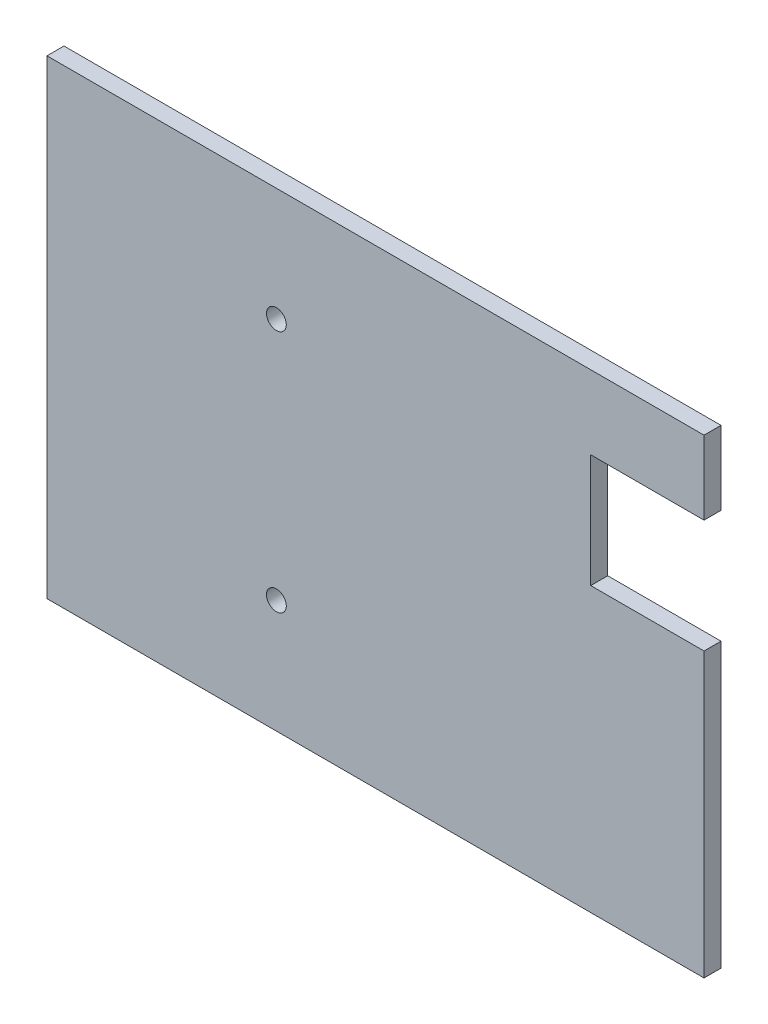
ISO-10303-21;
HEADER;
FILE_DESCRIPTION(('STEP AP214'),'2;1');
FILE_NAME('part.step','',(''),(''),'','','');
FILE_SCHEMA(('AUTOMOTIVE_DESIGN { 1 0 10303 214 1 1 1 1 }'));
ENDSEC;
DATA;
#1=APPLICATION_CONTEXT('core data for automotive mechanical design processes');
#2=APPLICATION_PROTOCOL_DEFINITION('international standard','automotive_design',2000,#1);
#3=PRODUCT_CONTEXT('',#1,'mechanical');
#4=PRODUCT('Part','Part','',(#3));
#5=PRODUCT_RELATED_PRODUCT_CATEGORY('part','',(#4));
#6=PRODUCT_DEFINITION_FORMATION('','',#4);
#7=PRODUCT_DEFINITION_CONTEXT('part definition',#1,'design');
#8=PRODUCT_DEFINITION('design','',#6,#7);
#9=PRODUCT_DEFINITION_SHAPE('','',#8);
#10=(LENGTH_UNIT() NAMED_UNIT(*) SI_UNIT(.MILLI.,.METRE.));
#11=(NAMED_UNIT(*) PLANE_ANGLE_UNIT() SI_UNIT($,.RADIAN.));
#12=(NAMED_UNIT(*) SI_UNIT($,.STERADIAN.) SOLID_ANGLE_UNIT());
#13=UNCERTAINTY_MEASURE_WITH_UNIT(LENGTH_MEASURE(1.E-05),#10,'distance_accuracy_value','');
#14=(GEOMETRIC_REPRESENTATION_CONTEXT(3) GLOBAL_UNCERTAINTY_ASSIGNED_CONTEXT((#13)) GLOBAL_UNIT_ASSIGNED_CONTEXT((#10,
#11,#12)) REPRESENTATION_CONTEXT('',''));
#15=CARTESIAN_POINT('',(0.,0.,0.));
#16=DIRECTION('',(0.,0.,1.));
#17=DIRECTION('',(1.,0.,0.));
#18=AXIS2_PLACEMENT_3D('',#15,#16,#17);
#19=CARTESIAN_POINT('',(0.,83.,3.));
#20=DIRECTION('',(-1.,0.,0.));
#21=DIRECTION('',(0.,0.,1.));
#22=AXIS2_PLACEMENT_3D('',#19,#20,#21);
#23=PLANE('',#22);
#24=DIRECTION('',(0.,1.,0.));
#25=VECTOR('',#24,1.);
#26=CARTESIAN_POINT('',(0.,83.,0.));
#27=LINE('',#26,#25);
#28=CARTESIAN_POINT('',(0.,0.,0.));
#29=VERTEX_POINT('',#28);
#30=CARTESIAN_POINT('',(0.,50.,0.));
#31=VERTEX_POINT('',#30);
#32=EDGE_CURVE('E145',#29,#31,#27,.T.);
#33=ORIENTED_EDGE('',*,*,#32,.T.);
#34=DIRECTION('',(0.,0.,1.));
#35=VECTOR('',#34,1.);
#36=CARTESIAN_POINT('',(0.,50.,3.));
#37=LINE('',#36,#35);
#38=CARTESIAN_POINT('',(0.,50.,3.));
#39=VERTEX_POINT('',#38);
#40=EDGE_CURVE('E43',#31,#39,#37,.T.);
#41=ORIENTED_EDGE('',*,*,#40,.T.);
#42=DIRECTION('',(0.,1.,0.));
#43=VECTOR('',#42,1.);
#44=CARTESIAN_POINT('',(0.,83.,3.));
#45=LINE('',#44,#43);
#46=CARTESIAN_POINT('',(0.,0.,3.));
#47=VERTEX_POINT('',#46);
#48=EDGE_CURVE('E129',#47,#39,#45,.T.);
#49=ORIENTED_EDGE('',*,*,#48,.F.);
#50=DIRECTION('',(0.,0.,-1.));
#51=VECTOR('',#50,1.);
#52=CARTESIAN_POINT('',(0.,0.,3.));
#53=LINE('',#52,#51);
#54=EDGE_CURVE('E151',#47,#29,#53,.T.);
#55=ORIENTED_EDGE('',*,*,#54,.T.);
#56=EDGE_LOOP('',(#33,#41,#49,#55));
#57=FACE_BOUND('',#56,.T.);
#58=ADVANCED_FACE('F35',(#57),#23,.F.);
#59=CARTESIAN_POINT('',(0.,0.,3.));
#60=DIRECTION('',(0.,0.,1.));
#61=DIRECTION('',(1.,0.,0.));
#62=AXIS2_PLACEMENT_3D('',#59,#60,#61);
#63=PLANE('',#62);
#64=DIRECTION('',(1.,0.,0.));
#65=VECTOR('',#64,1.);
#66=CARTESIAN_POINT('',(0.,50.,3.));
#67=LINE('',#66,#65);
#68=CARTESIAN_POINT('',(-20.,50.,3.));
#69=VERTEX_POINT('',#68);
#70=EDGE_CURVE('E167',#69,#39,#67,.T.);
#71=ORIENTED_EDGE('',*,*,#70,.F.);
#72=DIRECTION('',(0.,-1.,0.));
#73=VECTOR('',#72,1.);
#74=CARTESIAN_POINT('',(-20.,70.,3.));
#75=LINE('',#74,#73);
#76=CARTESIAN_POINT('',(-20.,70.,3.));
#77=VERTEX_POINT('',#76);
#78=EDGE_CURVE('E125',#77,#69,#75,.T.);
#79=ORIENTED_EDGE('',*,*,#78,.F.);
#80=DIRECTION('',(-1.,0.,0.));
#81=VECTOR('',#80,1.);
#82=CARTESIAN_POINT('',(0.,70.,3.));
#83=LINE('',#82,#81);
#84=CARTESIAN_POINT('',(0.,70.,3.));
#85=VERTEX_POINT('',#84);
#86=EDGE_CURVE('E112',#85,#77,#83,.T.);
#87=ORIENTED_EDGE('',*,*,#86,.F.);
#88=CARTESIAN_POINT('',(0.,83.,3.));
#89=VERTEX_POINT('',#88);
#90=EDGE_CURVE('E122',#85,#89,#45,.T.);
#91=ORIENTED_EDGE('',*,*,#90,.T.);
#92=DIRECTION('',(-1.,0.,0.));
#93=VECTOR('',#92,1.);
#94=CARTESIAN_POINT('',(-116.,83.,3.));
#95=LINE('',#94,#93);
#96=CARTESIAN_POINT('',(-116.,83.,3.));
#97=VERTEX_POINT('',#96);
#98=EDGE_CURVE('E59',#89,#97,#95,.T.);
#99=ORIENTED_EDGE('',*,*,#98,.T.);
#100=DIRECTION('',(0.,-1.,0.));
#101=VECTOR('',#100,1.);
#102=CARTESIAN_POINT('',(-116.,83.,3.));
#103=LINE('',#102,#101);
#104=CARTESIAN_POINT('',(-116.,0.,3.));
#105=VERTEX_POINT('',#104);
#106=EDGE_CURVE('E132',#97,#105,#103,.T.);
#107=ORIENTED_EDGE('',*,*,#106,.T.);
#108=DIRECTION('',(1.,0.,0.));
#109=VECTOR('',#108,1.);
#110=CARTESIAN_POINT('',(-116.,0.,3.));
#111=LINE('',#110,#109);
#112=EDGE_CURVE('E88',#105,#47,#111,.T.);
#113=ORIENTED_EDGE('',*,*,#112,.T.);
#114=ORIENTED_EDGE('',*,*,#48,.T.);
#115=EDGE_LOOP('',(#71,#79,#87,#91,#99,#107,#113,#114));
#116=FACE_BOUND('',#115,.T.);
#117=CARTESIAN_POINT('',(-75.5,20.,3.));
#118=DIRECTION('',(0.,0.,1.));
#119=DIRECTION('',(1.,0.,0.));
#120=AXIS2_PLACEMENT_3D('',#117,#118,#119);
#121=CIRCLE('',#120,1.75);
#122=CARTESIAN_POINT('',(-73.75,20.,3.));
#123=VERTEX_POINT('',#122);
#124=EDGE_CURVE('E160',#123,#123,#121,.T.);
#125=ORIENTED_EDGE('',*,*,#124,.F.);
#126=EDGE_LOOP('',(#125));
#127=FACE_BOUND('',#126,.T.);
#128=CARTESIAN_POINT('',(-75.5,63.,3.));
#129=DIRECTION('',(0.,0.,1.));
#130=DIRECTION('',(1.,0.,0.));
#131=AXIS2_PLACEMENT_3D('',#128,#129,#130);
#132=CIRCLE('',#131,1.75);
#133=CARTESIAN_POINT('',(-73.75,63.,3.));
#134=VERTEX_POINT('',#133);
#135=EDGE_CURVE('E157',#134,#134,#132,.T.);
#136=ORIENTED_EDGE('',*,*,#135,.F.);
#137=EDGE_LOOP('',(#136));
#138=FACE_BOUND('',#137,.T.);
#139=ADVANCED_FACE('F120',(#116,#127,#138),#63,.T.);
#140=CARTESIAN_POINT('',(0.,0.,0.));
#141=DIRECTION('',(0.,0.,1.));
#142=DIRECTION('',(1.,0.,0.));
#143=AXIS2_PLACEMENT_3D('',#140,#141,#142);
#144=PLANE('',#143);
#145=CARTESIAN_POINT('',(-75.5,20.,0.));
#146=DIRECTION('',(0.,0.,1.));
#147=DIRECTION('',(1.,0.,0.));
#148=AXIS2_PLACEMENT_3D('',#145,#146,#147);
#149=CIRCLE('',#148,1.75);
#150=CARTESIAN_POINT('',(-73.75,20.,0.));
#151=VERTEX_POINT('',#150);
#152=EDGE_CURVE('E158',#151,#151,#149,.T.);
#153=ORIENTED_EDGE('',*,*,#152,.T.);
#154=EDGE_LOOP('',(#153));
#155=FACE_BOUND('',#154,.T.);
#156=CARTESIAN_POINT('',(-75.5,63.,0.));
#157=DIRECTION('',(0.,0.,1.));
#158=DIRECTION('',(1.,0.,0.));
#159=AXIS2_PLACEMENT_3D('',#156,#157,#158);
#160=CIRCLE('',#159,1.75);
#161=CARTESIAN_POINT('',(-73.75,63.,0.));
#162=VERTEX_POINT('',#161);
#163=EDGE_CURVE('E142',#162,#162,#160,.T.);
#164=ORIENTED_EDGE('',*,*,#163,.T.);
#165=EDGE_LOOP('',(#164));
#166=FACE_BOUND('',#165,.T.);
#167=DIRECTION('',(0.,-1.,0.));
#168=VECTOR('',#167,1.);
#169=CARTESIAN_POINT('',(-20.,0.,0.));
#170=LINE('',#169,#168);
#171=CARTESIAN_POINT('',(-20.,70.,0.));
#172=VERTEX_POINT('',#171);
#173=CARTESIAN_POINT('',(-20.,50.,0.));
#174=VERTEX_POINT('',#173);
#175=EDGE_CURVE('E11',#172,#174,#170,.T.);
#176=ORIENTED_EDGE('',*,*,#175,.T.);
#177=DIRECTION('',(1.,0.,0.));
#178=VECTOR('',#177,1.);
#179=CARTESIAN_POINT('',(0.,50.,0.));
#180=LINE('',#179,#178);
#181=EDGE_CURVE('E174',#174,#31,#180,.T.);
#182=ORIENTED_EDGE('',*,*,#181,.T.);
#183=ORIENTED_EDGE('',*,*,#32,.F.);
#184=DIRECTION('',(1.,0.,0.));
#185=VECTOR('',#184,1.);
#186=CARTESIAN_POINT('',(-116.,0.,0.));
#187=LINE('',#186,#185);
#188=CARTESIAN_POINT('',(-116.,0.,0.));
#189=VERTEX_POINT('',#188);
#190=EDGE_CURVE('E141',#189,#29,#187,.T.);
#191=ORIENTED_EDGE('',*,*,#190,.F.);
#192=DIRECTION('',(0.,-1.,0.));
#193=VECTOR('',#192,1.);
#194=CARTESIAN_POINT('',(-116.,83.,0.));
#195=LINE('',#194,#193);
#196=CARTESIAN_POINT('',(-116.,83.,0.));
#197=VERTEX_POINT('',#196);
#198=EDGE_CURVE('E138',#197,#189,#195,.T.);
#199=ORIENTED_EDGE('',*,*,#198,.F.);
#200=DIRECTION('',(-1.,0.,0.));
#201=VECTOR('',#200,1.);
#202=CARTESIAN_POINT('',(-116.,83.,0.));
#203=LINE('',#202,#201);
#204=CARTESIAN_POINT('',(0.,83.,0.));
#205=VERTEX_POINT('',#204);
#206=EDGE_CURVE('E80',#205,#197,#203,.T.);
#207=ORIENTED_EDGE('',*,*,#206,.F.);
#208=CARTESIAN_POINT('',(0.,70.,0.));
#209=VERTEX_POINT('',#208);
#210=EDGE_CURVE('E144',#209,#205,#27,.T.);
#211=ORIENTED_EDGE('',*,*,#210,.F.);
#212=DIRECTION('',(-1.,0.,0.));
#213=VECTOR('',#212,1.);
#214=CARTESIAN_POINT('',(0.,70.,0.));
#215=LINE('',#214,#213);
#216=EDGE_CURVE('E50',#209,#172,#215,.T.);
#217=ORIENTED_EDGE('',*,*,#216,.T.);
#218=EDGE_LOOP('',(#176,#182,#183,#191,#199,#207,#211,#217));
#219=FACE_BOUND('',#218,.T.);
#220=ADVANCED_FACE('F172',(#155,#166,#219),#144,.F.);
#221=CARTESIAN_POINT('',(-116.,83.,3.));
#222=DIRECTION('',(1.,0.,0.));
#223=DIRECTION('',(0.,1.,0.));
#224=AXIS2_PLACEMENT_3D('',#221,#222,#223);
#225=PLANE('',#224);
#226=ORIENTED_EDGE('',*,*,#198,.T.);
#227=DIRECTION('',(0.,0.,-1.));
#228=VECTOR('',#227,1.);
#229=CARTESIAN_POINT('',(-116.,0.,3.));
#230=LINE('',#229,#228);
#231=EDGE_CURVE('E117',#105,#189,#230,.T.);
#232=ORIENTED_EDGE('',*,*,#231,.F.);
#233=ORIENTED_EDGE('',*,*,#106,.F.);
#234=DIRECTION('',(0.,0.,-1.));
#235=VECTOR('',#234,1.);
#236=CARTESIAN_POINT('',(-116.,83.,3.));
#237=LINE('',#236,#235);
#238=EDGE_CURVE('E137',#97,#197,#237,.T.);
#239=ORIENTED_EDGE('',*,*,#238,.T.);
#240=EDGE_LOOP('',(#226,#232,#233,#239));
#241=FACE_BOUND('',#240,.T.);
#242=ADVANCED_FACE('F37',(#241),#225,.F.);
#243=CARTESIAN_POINT('',(-116.,0.,3.));
#244=DIRECTION('',(0.,1.,0.));
#245=DIRECTION('',(0.,0.,1.));
#246=AXIS2_PLACEMENT_3D('',#243,#244,#245);
#247=PLANE('',#246);
#248=ORIENTED_EDGE('',*,*,#190,.T.);
#249=ORIENTED_EDGE('',*,*,#54,.F.);
#250=ORIENTED_EDGE('',*,*,#112,.F.);
#251=ORIENTED_EDGE('',*,*,#231,.T.);
#252=EDGE_LOOP('',(#248,#249,#250,#251));
#253=FACE_BOUND('',#252,.T.);
#254=ADVANCED_FACE('F170',(#253),#247,.F.);
#255=ORIENTED_EDGE('',*,*,#90,.F.);
#256=DIRECTION('',(0.,0.,-1.));
#257=VECTOR('',#256,1.);
#258=CARTESIAN_POINT('',(0.,70.,3.));
#259=LINE('',#258,#257);
#260=EDGE_CURVE('E109',#85,#209,#259,.T.);
#261=ORIENTED_EDGE('',*,*,#260,.T.);
#262=ORIENTED_EDGE('',*,*,#210,.T.);
#263=DIRECTION('',(0.,0.,-1.));
#264=VECTOR('',#263,1.);
#265=CARTESIAN_POINT('',(0.,83.,3.));
#266=LINE('',#265,#264);
#267=EDGE_CURVE('E128',#89,#205,#266,.T.);
#268=ORIENTED_EDGE('',*,*,#267,.F.);
#269=EDGE_LOOP('',(#255,#261,#262,#268));
#270=FACE_BOUND('',#269,.T.);
#271=ADVANCED_FACE('F127',(#270),#23,.F.);
#272=CARTESIAN_POINT('',(-116.,83.,3.));
#273=DIRECTION('',(0.,-1.,0.));
#274=DIRECTION('',(0.,0.,-1.));
#275=AXIS2_PLACEMENT_3D('',#272,#273,#274);
#276=PLANE('',#275);
#277=ORIENTED_EDGE('',*,*,#206,.T.);
#278=ORIENTED_EDGE('',*,*,#238,.F.);
#279=ORIENTED_EDGE('',*,*,#98,.F.);
#280=ORIENTED_EDGE('',*,*,#267,.T.);
#281=EDGE_LOOP('',(#277,#278,#279,#280));
#282=FACE_BOUND('',#281,.T.);
#283=ADVANCED_FACE('F201',(#282),#276,.F.);
#284=CARTESIAN_POINT('',(-75.5,63.,-27.));
#285=DIRECTION('',(0.,0.,1.));
#286=DIRECTION('',(1.,0.,0.));
#287=AXIS2_PLACEMENT_3D('',#284,#285,#286);
#288=CYLINDRICAL_SURFACE('',#287,1.75);
#289=ORIENTED_EDGE('',*,*,#135,.T.);
#290=EDGE_LOOP('',(#289));
#291=FACE_BOUND('',#290,.T.);
#292=ORIENTED_EDGE('',*,*,#163,.F.);
#293=EDGE_LOOP('',(#292));
#294=FACE_BOUND('',#293,.T.);
#295=ADVANCED_FACE('F186',(#291,#294),#288,.F.);
#296=CARTESIAN_POINT('',(-75.5,20.,-27.));
#297=DIRECTION('',(0.,0.,1.));
#298=DIRECTION('',(1.,0.,0.));
#299=AXIS2_PLACEMENT_3D('',#296,#297,#298);
#300=CYLINDRICAL_SURFACE('',#299,1.75);
#301=ORIENTED_EDGE('',*,*,#124,.T.);
#302=EDGE_LOOP('',(#301));
#303=FACE_BOUND('',#302,.T.);
#304=ORIENTED_EDGE('',*,*,#152,.F.);
#305=EDGE_LOOP('',(#304));
#306=FACE_BOUND('',#305,.T.);
#307=ADVANCED_FACE('F239',(#303,#306),#300,.F.);
#308=CARTESIAN_POINT('',(-20.,70.,-7.));
#309=DIRECTION('',(-1.,0.,0.));
#310=DIRECTION('',(0.,-1.,0.));
#311=AXIS2_PLACEMENT_3D('',#308,#309,#310);
#312=PLANE('',#311);
#313=DIRECTION('',(0.,0.,1.));
#314=VECTOR('',#313,1.);
#315=CARTESIAN_POINT('',(-20.,70.,-7.));
#316=LINE('',#315,#314);
#317=EDGE_CURVE('E307',#172,#77,#316,.T.);
#318=ORIENTED_EDGE('',*,*,#317,.T.);
#319=ORIENTED_EDGE('',*,*,#78,.T.);
#320=DIRECTION('',(0.,0.,1.));
#321=VECTOR('',#320,1.);
#322=CARTESIAN_POINT('',(-20.,50.,-7.));
#323=LINE('',#322,#321);
#324=EDGE_CURVE('E179',#174,#69,#323,.T.);
#325=ORIENTED_EDGE('',*,*,#324,.F.);
#326=ORIENTED_EDGE('',*,*,#175,.F.);
#327=EDGE_LOOP('',(#318,#319,#325,#326));
#328=FACE_BOUND('',#327,.T.);
#329=ADVANCED_FACE('F233',(#328),#312,.F.);
#330=CARTESIAN_POINT('',(0.,50.,-7.));
#331=DIRECTION('',(0.,-1.,0.));
#332=DIRECTION('',(0.,0.,-1.));
#333=AXIS2_PLACEMENT_3D('',#330,#331,#332);
#334=PLANE('',#333);
#335=ORIENTED_EDGE('',*,*,#324,.T.);
#336=ORIENTED_EDGE('',*,*,#70,.T.);
#337=ORIENTED_EDGE('',*,*,#40,.F.);
#338=ORIENTED_EDGE('',*,*,#181,.F.);
#339=EDGE_LOOP('',(#335,#336,#337,#338));
#340=FACE_BOUND('',#339,.T.);
#341=ADVANCED_FACE('F238',(#340),#334,.F.);
#342=CARTESIAN_POINT('',(0.,70.,-7.));
#343=DIRECTION('',(0.,1.,0.));
#344=DIRECTION('',(0.,0.,1.));
#345=AXIS2_PLACEMENT_3D('',#342,#343,#344);
#346=PLANE('',#345);
#347=ORIENTED_EDGE('',*,*,#260,.F.);
#348=ORIENTED_EDGE('',*,*,#86,.T.);
#349=ORIENTED_EDGE('',*,*,#317,.F.);
#350=ORIENTED_EDGE('',*,*,#216,.F.);
#351=EDGE_LOOP('',(#347,#348,#349,#350));
#352=FACE_BOUND('',#351,.T.);
#353=ADVANCED_FACE('F111',(#352),#346,.F.);
#354=CLOSED_SHELL('',(#58,#139,#220,#242,#254,#271,#283,#295,#307,#329,#341,#353));
#355=MANIFOLD_SOLID_BREP('B2',#354);
#356=ADVANCED_BREP_SHAPE_REPRESENTATION('',(#18,#355),#14);
#357=SHAPE_DEFINITION_REPRESENTATION(#9,#356);
ENDSEC;
END-ISO-10303-21;
